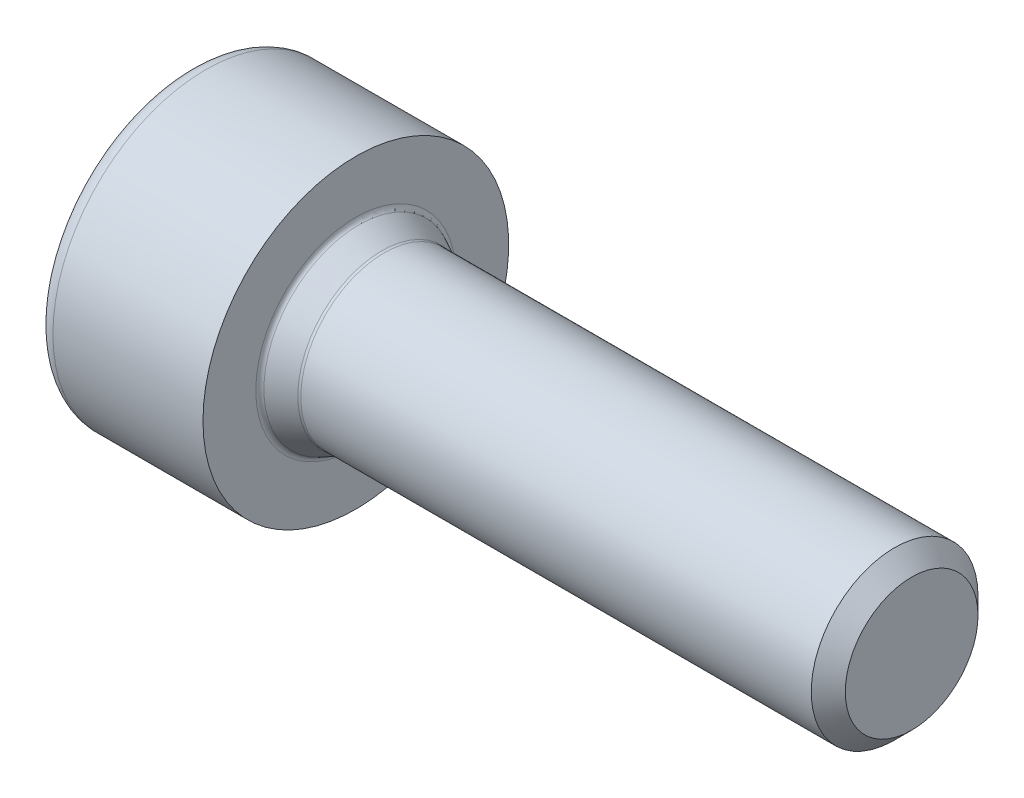
ISO-10303-21;
HEADER;
FILE_DESCRIPTION(('STEP AP214'),'2;1');
FILE_NAME('part.step','',(''),(''),'','','');
FILE_SCHEMA(('AUTOMOTIVE_DESIGN { 1 0 10303 214 1 1 1 1 }'));
ENDSEC;
DATA;
#1=APPLICATION_CONTEXT('core data for automotive mechanical design processes');
#2=APPLICATION_PROTOCOL_DEFINITION('international standard','automotive_design',2000,#1);
#3=PRODUCT_CONTEXT('',#1,'mechanical');
#4=PRODUCT('Part','Part','',(#3));
#5=PRODUCT_RELATED_PRODUCT_CATEGORY('part','',(#4));
#6=PRODUCT_DEFINITION_FORMATION('','',#4);
#7=PRODUCT_DEFINITION_CONTEXT('part definition',#1,'design');
#8=PRODUCT_DEFINITION('design','',#6,#7);
#9=PRODUCT_DEFINITION_SHAPE('','',#8);
#10=(LENGTH_UNIT() NAMED_UNIT(*) SI_UNIT(.MILLI.,.METRE.));
#11=(NAMED_UNIT(*) PLANE_ANGLE_UNIT() SI_UNIT($,.RADIAN.));
#12=(NAMED_UNIT(*) SI_UNIT($,.STERADIAN.) SOLID_ANGLE_UNIT());
#13=UNCERTAINTY_MEASURE_WITH_UNIT(LENGTH_MEASURE(1.E-05),#10,'distance_accuracy_value','');
#14=(GEOMETRIC_REPRESENTATION_CONTEXT(3) GLOBAL_UNCERTAINTY_ASSIGNED_CONTEXT((#13)) GLOBAL_UNIT_ASSIGNED_CONTEXT((#10,
#11,#12)) REPRESENTATION_CONTEXT('',''));
#15=CARTESIAN_POINT('',(0.,0.,0.));
#16=DIRECTION('',(0.,0.,1.));
#17=DIRECTION('',(1.,0.,0.));
#18=AXIS2_PLACEMENT_3D('',#15,#16,#17);
#19=CARTESIAN_POINT('',(-3.,-2.45,2.45));
#20=DIRECTION('',(-1.,0.,0.));
#21=DIRECTION('',(0.,1.,0.));
#22=AXIS2_PLACEMENT_3D('',#19,#20,#21);
#23=PLANE('',#22);
#24=CARTESIAN_POINT('',(-3.,0.,0.));
#25=DIRECTION('',(-1.,0.,0.));
#26=DIRECTION('',(0.,0.,-1.));
#27=AXIS2_PLACEMENT_3D('',#24,#25,#26);
#28=CIRCLE('',#27,2.45000003462729);
#29=CARTESIAN_POINT('',(-3.,0.,-2.45000003462729));
#30=VERTEX_POINT('',#29);
#31=EDGE_CURVE('E107',#30,#30,#28,.F.);
#32=ORIENTED_EDGE('',*,*,#31,.F.);
#33=EDGE_LOOP('',(#32));
#34=FACE_BOUND('',#33,.T.);
#35=DIRECTION('',(0.,-0.500000000000021,0.866025403784427));
#36=VECTOR('',#35,1.);
#37=CARTESIAN_POINT('',(-3.,1.4433756729741,0.));
#38=LINE('',#37,#36);
#39=CARTESIAN_POINT('',(-3.,1.4433756729741,0.));
#40=VERTEX_POINT('',#39);
#41=CARTESIAN_POINT('',(-3.,0.721687836487028,1.25));
#42=VERTEX_POINT('',#41);
#43=EDGE_CURVE('E90',#40,#42,#38,.T.);
#44=ORIENTED_EDGE('',*,*,#43,.T.);
#45=DIRECTION('',(0.,-1.,0.));
#46=VECTOR('',#45,1.);
#47=CARTESIAN_POINT('',(-3.,0.72168783648703,1.25));
#48=LINE('',#47,#46);
#49=CARTESIAN_POINT('',(-3.,-0.72168783648703,1.25));
#50=VERTEX_POINT('',#49);
#51=EDGE_CURVE('E104',#42,#50,#48,.T.);
#52=ORIENTED_EDGE('',*,*,#51,.T.);
#53=DIRECTION('',(0.,-0.50000000000002,-0.866025403784427));
#54=VECTOR('',#53,1.);
#55=CARTESIAN_POINT('',(-3.,-0.72168783648703,1.25));
#56=LINE('',#55,#54);
#57=CARTESIAN_POINT('',(-3.,-1.4433756729741,0.));
#58=VERTEX_POINT('',#57);
#59=EDGE_CURVE('E112',#50,#58,#56,.T.);
#60=ORIENTED_EDGE('',*,*,#59,.T.);
#61=DIRECTION('',(0.,0.50000000000002,-0.866025403784427));
#62=VECTOR('',#61,1.);
#63=CARTESIAN_POINT('',(-3.,-1.4433756729741,0.));
#64=LINE('',#63,#62);
#65=CARTESIAN_POINT('',(-3.,-0.72168783648703,-1.25));
#66=VERTEX_POINT('',#65);
#67=EDGE_CURVE('E114',#58,#66,#64,.T.);
#68=ORIENTED_EDGE('',*,*,#67,.T.);
#69=DIRECTION('',(0.,1.,0.));
#70=VECTOR('',#69,1.);
#71=CARTESIAN_POINT('',(-3.,-0.72168783648703,-1.25));
#72=LINE('',#71,#70);
#73=CARTESIAN_POINT('',(-3.,0.72168783648703,-1.25));
#74=VERTEX_POINT('',#73);
#75=EDGE_CURVE('E125',#66,#74,#72,.T.);
#76=ORIENTED_EDGE('',*,*,#75,.T.);
#77=DIRECTION('',(0.,0.500000000000021,0.866025403784427));
#78=VECTOR('',#77,1.);
#79=CARTESIAN_POINT('',(-3.,0.721687836487028,-1.25));
#80=LINE('',#79,#78);
#81=EDGE_CURVE('E106',#74,#40,#80,.T.);
#82=ORIENTED_EDGE('',*,*,#81,.T.);
#83=EDGE_LOOP('',(#44,#52,#60,#68,#76,#82));
#84=FACE_BOUND('',#83,.T.);
#85=ADVANCED_FACE('F17',(#34,#84),#23,.T.);
#86=CARTESIAN_POINT('',(0.,-2.75,-2.75));
#87=DIRECTION('',(1.,0.,0.));
#88=DIRECTION('',(0.,1.,0.));
#89=AXIS2_PLACEMENT_3D('',#86,#87,#88);
#90=PLANE('',#89);
#91=CARTESIAN_POINT('',(0.,0.,0.));
#92=DIRECTION('',(1.,0.,0.));
#93=DIRECTION('',(0.,0.,1.));
#94=AXIS2_PLACEMENT_3D('',#91,#92,#93);
#95=CIRCLE('',#94,2.75);
#96=CARTESIAN_POINT('',(0.,0.,2.75));
#97=VERTEX_POINT('',#96);
#98=EDGE_CURVE('E132',#97,#97,#95,.T.);
#99=ORIENTED_EDGE('',*,*,#98,.T.);
#100=EDGE_LOOP('',(#99));
#101=FACE_BOUND('',#100,.T.);
#102=CARTESIAN_POINT('',(0.,0.,0.));
#103=DIRECTION('',(-1.,0.,0.));
#104=DIRECTION('',(0.,0.,-1.));
#105=AXIS2_PLACEMENT_3D('',#102,#103,#104);
#106=CIRCLE('',#105,1.8);
#107=CARTESIAN_POINT('',(0.,0.,-1.8));
#108=VERTEX_POINT('',#107);
#109=EDGE_CURVE('E137',#108,#108,#106,.F.);
#110=ORIENTED_EDGE('',*,*,#109,.F.);
#111=EDGE_LOOP('',(#110));
#112=FACE_BOUND('',#111,.T.);
#113=ADVANCED_FACE('F276',(#101,#112),#90,.T.);
#114=CARTESIAN_POINT('',(10.,-1.20903464106758,-1.1935));
#115=DIRECTION('',(1.,0.,0.));
#116=DIRECTION('',(0.,1.,0.));
#117=AXIS2_PLACEMENT_3D('',#114,#115,#116);
#118=PLANE('',#117);
#119=CARTESIAN_POINT('',(10.,0.,0.));
#120=DIRECTION('',(1.,0.,0.));
#121=DIRECTION('',(0.,-1.41924965844718E-07,0.99999999999999));
#122=AXIS2_PLACEMENT_3D('',#119,#120,#121);
#123=CIRCLE('',#122,1.1935);
#124=CARTESIAN_POINT('',(10.,-1.69387446735671E-07,1.19349999999999));
#125=VERTEX_POINT('',#124);
#126=EDGE_CURVE('E140',#125,#125,#123,.T.);
#127=ORIENTED_EDGE('',*,*,#126,.T.);
#128=EDGE_LOOP('',(#127));
#129=FACE_BOUND('',#128,.T.);
#130=ADVANCED_FACE('F278',(#129),#118,.T.);
#131=CARTESIAN_POINT('',(-1.15,-1.08253175473054,-0.625000000000031));
#132=DIRECTION('',(-1.,0.,0.));
#133=DIRECTION('',(0.,1.,0.));
#134=AXIS2_PLACEMENT_3D('',#131,#132,#133);
#135=PLANE('',#134);
#136=DIRECTION('',(0.,-1.,0.));
#137=VECTOR('',#136,1.);
#138=CARTESIAN_POINT('',(-1.15,0.,-1.25));
#139=LINE('',#138,#137);
#140=CARTESIAN_POINT('',(-1.15,-0.72168783648703,-1.25));
#141=VERTEX_POINT('',#140);
#142=CARTESIAN_POINT('',(-1.15,0.,-1.25));
#143=VERTEX_POINT('',#142);
#144=EDGE_CURVE('E143',#141,#143,#139,.F.);
#145=ORIENTED_EDGE('',*,*,#144,.F.);
#146=DIRECTION('',(0.,-0.500000000000018,0.866025403784429));
#147=VECTOR('',#146,1.);
#148=CARTESIAN_POINT('',(-1.15,-0.721687836487029,-1.25));
#149=LINE('',#148,#147);
#150=CARTESIAN_POINT('',(-1.15,-1.08253175473054,-0.625000000000031));
#151=VERTEX_POINT('',#150);
#152=EDGE_CURVE('E146',#151,#141,#149,.F.);
#153=ORIENTED_EDGE('',*,*,#152,.F.);
#154=CARTESIAN_POINT('',(-1.15,0.,0.));
#155=DIRECTION('',(1.,0.,0.));
#156=DIRECTION('',(0.,-0.866025403784427,-0.50000000000002));
#157=AXIS2_PLACEMENT_3D('',#154,#155,#156);
#158=CIRCLE('',#157,1.25);
#159=EDGE_CURVE('E151',#151,#143,#158,.T.);
#160=ORIENTED_EDGE('',*,*,#159,.T.);
#161=EDGE_LOOP('',(#145,#153,#160));
#162=FACE_BOUND('',#161,.T.);
#163=ADVANCED_FACE('F286',(#162),#135,.T.);
#164=CARTESIAN_POINT('',(-1.15,-1.4433756729741,0.625000000000031));
#165=DIRECTION('',(-1.,0.,0.));
#166=DIRECTION('',(0.,1.,0.));
#167=AXIS2_PLACEMENT_3D('',#164,#165,#166);
#168=PLANE('',#167);
#169=DIRECTION('',(0.,-0.500000000000024,0.866025403784425));
#170=VECTOR('',#169,1.);
#171=CARTESIAN_POINT('',(-1.15,-1.08253175473054,-0.625000000000031));
#172=LINE('',#171,#170);
#173=CARTESIAN_POINT('',(-1.15,-1.4433756729741,0.));
#174=VERTEX_POINT('',#173);
#175=EDGE_CURVE('E156',#174,#151,#172,.F.);
#176=ORIENTED_EDGE('',*,*,#175,.F.);
#177=DIRECTION('',(0.,0.500000000000023,0.866025403784426));
#178=VECTOR('',#177,1.);
#179=CARTESIAN_POINT('',(-1.15,-1.4433756729741,0.));
#180=LINE('',#179,#178);
#181=CARTESIAN_POINT('',(-1.15,-1.08253175473054,0.625000000000031));
#182=VERTEX_POINT('',#181);
#183=EDGE_CURVE('E160',#182,#174,#180,.F.);
#184=ORIENTED_EDGE('',*,*,#183,.F.);
#185=CARTESIAN_POINT('',(-1.15,0.,0.));
#186=DIRECTION('',(1.,0.,0.));
#187=DIRECTION('',(0.,-0.866025403784427,0.50000000000002));
#188=AXIS2_PLACEMENT_3D('',#185,#186,#187);
#189=CIRCLE('',#188,1.25);
#190=EDGE_CURVE('E165',#182,#151,#189,.T.);
#191=ORIENTED_EDGE('',*,*,#190,.T.);
#192=EDGE_LOOP('',(#176,#184,#191));
#193=FACE_BOUND('',#192,.T.);
#194=ADVANCED_FACE('F294',(#193),#168,.T.);
#195=CARTESIAN_POINT('',(-1.15,-1.08253175473054,1.25));
#196=DIRECTION('',(-1.,0.,0.));
#197=DIRECTION('',(0.,1.,0.));
#198=AXIS2_PLACEMENT_3D('',#195,#196,#197);
#199=PLANE('',#198);
#200=DIRECTION('',(0.,0.500000000000018,0.866025403784429));
#201=VECTOR('',#200,1.);
#202=CARTESIAN_POINT('',(-1.15,-1.08253175473054,0.625000000000031));
#203=LINE('',#202,#201);
#204=CARTESIAN_POINT('',(-1.15,-0.72168783648703,1.25));
#205=VERTEX_POINT('',#204);
#206=EDGE_CURVE('E170',#205,#182,#203,.F.);
#207=ORIENTED_EDGE('',*,*,#206,.F.);
#208=DIRECTION('',(0.,1.,0.));
#209=VECTOR('',#208,1.);
#210=CARTESIAN_POINT('',(-1.15,-0.72168783648703,1.25));
#211=LINE('',#210,#209);
#212=CARTESIAN_POINT('',(-1.15,0.,1.25));
#213=VERTEX_POINT('',#212);
#214=EDGE_CURVE('E174',#213,#205,#211,.F.);
#215=ORIENTED_EDGE('',*,*,#214,.F.);
#216=CARTESIAN_POINT('',(-1.15,0.,0.));
#217=DIRECTION('',(1.,0.,0.));
#218=DIRECTION('',(0.,0.,1.));
#219=AXIS2_PLACEMENT_3D('',#216,#217,#218);
#220=CIRCLE('',#219,1.25);
#221=EDGE_CURVE('E178',#213,#182,#220,.T.);
#222=ORIENTED_EDGE('',*,*,#221,.T.);
#223=EDGE_LOOP('',(#207,#215,#222));
#224=FACE_BOUND('',#223,.T.);
#225=ADVANCED_FACE('F298',(#224),#199,.T.);
#226=CARTESIAN_POINT('',(-1.15,0.,1.25));
#227=DIRECTION('',(-1.,0.,0.));
#228=DIRECTION('',(0.,1.,0.));
#229=AXIS2_PLACEMENT_3D('',#226,#227,#228);
#230=PLANE('',#229);
#231=DIRECTION('',(0.,1.,0.));
#232=VECTOR('',#231,1.);
#233=CARTESIAN_POINT('',(-1.15,0.,1.25));
#234=LINE('',#233,#232);
#235=CARTESIAN_POINT('',(-1.15,0.72168783648703,1.25));
#236=VERTEX_POINT('',#235);
#237=EDGE_CURVE('E183',#236,#213,#234,.F.);
#238=ORIENTED_EDGE('',*,*,#237,.F.);
#239=DIRECTION('',(0.,0.500000000000018,-0.866025403784428));
#240=VECTOR('',#239,1.);
#241=CARTESIAN_POINT('',(-1.15,0.721687836487029,1.25));
#242=LINE('',#241,#240);
#243=CARTESIAN_POINT('',(-1.15,1.08253175473054,0.625000000000031));
#244=VERTEX_POINT('',#243);
#245=EDGE_CURVE('E93',#244,#236,#242,.F.);
#246=ORIENTED_EDGE('',*,*,#245,.F.);
#247=CARTESIAN_POINT('',(-1.15,0.,0.));
#248=DIRECTION('',(1.,0.,0.));
#249=DIRECTION('',(0.,0.866025403784427,0.50000000000002));
#250=AXIS2_PLACEMENT_3D('',#247,#248,#249);
#251=CIRCLE('',#250,1.25);
#252=EDGE_CURVE('E190',#244,#213,#251,.T.);
#253=ORIENTED_EDGE('',*,*,#252,.T.);
#254=EDGE_LOOP('',(#238,#246,#253));
#255=FACE_BOUND('',#254,.T.);
#256=ADVANCED_FACE('F302',(#255),#230,.T.);
#257=CARTESIAN_POINT('',(-1.15,1.08253175473054,0.625000000000031));
#258=DIRECTION('',(-1.,0.,0.));
#259=DIRECTION('',(0.,1.,0.));
#260=AXIS2_PLACEMENT_3D('',#257,#258,#259);
#261=PLANE('',#260);
#262=DIRECTION('',(0.,0.500000000000024,-0.866025403784425));
#263=VECTOR('',#262,1.);
#264=CARTESIAN_POINT('',(-1.15,1.08253175473054,0.625000000000031));
#265=LINE('',#264,#263);
#266=CARTESIAN_POINT('',(-1.15,1.4433756729741,0.));
#267=VERTEX_POINT('',#266);
#268=EDGE_CURVE('E195',#267,#244,#265,.F.);
#269=ORIENTED_EDGE('',*,*,#268,.F.);
#270=DIRECTION('',(0.,-0.500000000000023,-0.866025403784425));
#271=VECTOR('',#270,1.);
#272=CARTESIAN_POINT('',(-1.15,1.4433756729741,0.));
#273=LINE('',#272,#271);
#274=CARTESIAN_POINT('',(-1.15,1.08253175473054,-0.625000000000031));
#275=VERTEX_POINT('',#274);
#276=EDGE_CURVE('E199',#275,#267,#273,.F.);
#277=ORIENTED_EDGE('',*,*,#276,.F.);
#278=CARTESIAN_POINT('',(-1.15,0.,0.));
#279=DIRECTION('',(1.,0.,0.));
#280=DIRECTION('',(0.,0.866025403784427,-0.50000000000002));
#281=AXIS2_PLACEMENT_3D('',#278,#279,#280);
#282=CIRCLE('',#281,1.25);
#283=EDGE_CURVE('E204',#275,#244,#282,.T.);
#284=ORIENTED_EDGE('',*,*,#283,.T.);
#285=EDGE_LOOP('',(#269,#277,#284));
#286=FACE_BOUND('',#285,.T.);
#287=ADVANCED_FACE('F306',(#286),#261,.T.);
#288=CARTESIAN_POINT('',(-1.15,0.,-0.625000000000031));
#289=DIRECTION('',(-1.,0.,0.));
#290=DIRECTION('',(0.,1.,0.));
#291=AXIS2_PLACEMENT_3D('',#288,#289,#290);
#292=PLANE('',#291);
#293=DIRECTION('',(0.,-0.500000000000017,-0.866025403784429));
#294=VECTOR('',#293,1.);
#295=CARTESIAN_POINT('',(-1.15,1.08253175473054,-0.625000000000031));
#296=LINE('',#295,#294);
#297=CARTESIAN_POINT('',(-1.15,0.72168783648703,-1.25));
#298=VERTEX_POINT('',#297);
#299=EDGE_CURVE('E209',#298,#275,#296,.F.);
#300=ORIENTED_EDGE('',*,*,#299,.F.);
#301=DIRECTION('',(0.,-1.,0.));
#302=VECTOR('',#301,1.);
#303=CARTESIAN_POINT('',(-1.15,0.72168783648703,-1.25));
#304=LINE('',#303,#302);
#305=EDGE_CURVE('E213',#143,#298,#304,.F.);
#306=ORIENTED_EDGE('',*,*,#305,.F.);
#307=CARTESIAN_POINT('',(-1.15,0.,0.));
#308=DIRECTION('',(1.,0.,0.));
#309=DIRECTION('',(0.,0.,-1.));
#310=AXIS2_PLACEMENT_3D('',#307,#308,#309);
#311=CIRCLE('',#310,1.25);
#312=EDGE_CURVE('E218',#143,#275,#311,.T.);
#313=ORIENTED_EDGE('',*,*,#312,.T.);
#314=EDGE_LOOP('',(#300,#306,#313));
#315=FACE_BOUND('',#314,.T.);
#316=ADVANCED_FACE('F310',(#315),#292,.T.);
#317=CARTESIAN_POINT('',(-3.,-0.72168783648703,1.25));
#318=DIRECTION('',(0.,0.,-1.));
#319=DIRECTION('',(0.,1.,0.));
#320=AXIS2_PLACEMENT_3D('',#317,#318,#319);
#321=PLANE('',#320);
#322=ORIENTED_EDGE('',*,*,#214,.T.);
#323=DIRECTION('',(-1.,0.,0.));
#324=VECTOR('',#323,1.);
#325=CARTESIAN_POINT('',(-1.15,-0.72168783648703,1.25));
#326=LINE('',#325,#324);
#327=EDGE_CURVE('E98',#50,#205,#326,.F.);
#328=ORIENTED_EDGE('',*,*,#327,.F.);
#329=ORIENTED_EDGE('',*,*,#51,.F.);
#330=DIRECTION('',(1.,0.,0.));
#331=VECTOR('',#330,1.);
#332=CARTESIAN_POINT('',(-3.,0.72168783648703,1.25));
#333=LINE('',#332,#331);
#334=EDGE_CURVE('E87',#42,#236,#333,.T.);
#335=ORIENTED_EDGE('',*,*,#334,.T.);
#336=ORIENTED_EDGE('',*,*,#237,.T.);
#337=EDGE_LOOP('',(#322,#328,#329,#335,#336));
#338=FACE_BOUND('',#337,.T.);
#339=ADVANCED_FACE('F111',(#338),#321,.T.);
#340=CARTESIAN_POINT('',(-3.,-0.72168783648703,1.25));
#341=DIRECTION('',(0.,0.866025403784427,-0.50000000000002));
#342=DIRECTION('',(1.,0.,0.));
#343=AXIS2_PLACEMENT_3D('',#340,#341,#342);
#344=PLANE('',#343);
#345=ORIENTED_EDGE('',*,*,#183,.T.);
#346=DIRECTION('',(-1.,0.,0.));
#347=VECTOR('',#346,1.);
#348=CARTESIAN_POINT('',(-1.15,-1.4433756729741,0.));
#349=LINE('',#348,#347);
#350=EDGE_CURVE('E97',#58,#174,#349,.F.);
#351=ORIENTED_EDGE('',*,*,#350,.F.);
#352=ORIENTED_EDGE('',*,*,#59,.F.);
#353=ORIENTED_EDGE('',*,*,#327,.T.);
#354=ORIENTED_EDGE('',*,*,#206,.T.);
#355=EDGE_LOOP('',(#345,#351,#352,#353,#354));
#356=FACE_BOUND('',#355,.T.);
#357=ADVANCED_FACE('F317',(#356),#344,.T.);
#358=CARTESIAN_POINT('',(-3.,-1.4433756729741,0.));
#359=DIRECTION('',(0.,0.866025403784427,0.50000000000002));
#360=DIRECTION('',(1.,0.,0.));
#361=AXIS2_PLACEMENT_3D('',#358,#359,#360);
#362=PLANE('',#361);
#363=ORIENTED_EDGE('',*,*,#152,.T.);
#364=DIRECTION('',(-1.,0.,0.));
#365=VECTOR('',#364,1.);
#366=CARTESIAN_POINT('',(-1.15,-0.721687836487029,-1.25));
#367=LINE('',#366,#365);
#368=EDGE_CURVE('E231',#66,#141,#367,.F.);
#369=ORIENTED_EDGE('',*,*,#368,.F.);
#370=ORIENTED_EDGE('',*,*,#67,.F.);
#371=ORIENTED_EDGE('',*,*,#350,.T.);
#372=ORIENTED_EDGE('',*,*,#175,.T.);
#373=EDGE_LOOP('',(#363,#369,#370,#371,#372));
#374=FACE_BOUND('',#373,.T.);
#375=ADVANCED_FACE('F320',(#374),#362,.T.);
#376=CARTESIAN_POINT('',(-1.15,-0.72168783648703,-1.25));
#377=DIRECTION('',(0.,0.,1.));
#378=DIRECTION('',(0.,1.,0.));
#379=AXIS2_PLACEMENT_3D('',#376,#377,#378);
#380=PLANE('',#379);
#381=ORIENTED_EDGE('',*,*,#305,.T.);
#382=DIRECTION('',(-1.,0.,0.));
#383=VECTOR('',#382,1.);
#384=CARTESIAN_POINT('',(-1.15,0.72168783648703,-1.25));
#385=LINE('',#384,#383);
#386=EDGE_CURVE('E35',#74,#298,#385,.F.);
#387=ORIENTED_EDGE('',*,*,#386,.F.);
#388=ORIENTED_EDGE('',*,*,#75,.F.);
#389=ORIENTED_EDGE('',*,*,#368,.T.);
#390=ORIENTED_EDGE('',*,*,#144,.T.);
#391=EDGE_LOOP('',(#381,#387,#388,#389,#390));
#392=FACE_BOUND('',#391,.T.);
#393=ADVANCED_FACE('F324',(#392),#380,.T.);
#394=CARTESIAN_POINT('',(-3.,0.72168783648703,-1.25));
#395=DIRECTION('',(0.,-0.866025403784427,0.50000000000002));
#396=DIRECTION('',(1.,0.,0.));
#397=AXIS2_PLACEMENT_3D('',#394,#395,#396);
#398=PLANE('',#397);
#399=ORIENTED_EDGE('',*,*,#276,.T.);
#400=DIRECTION('',(-1.,0.,0.));
#401=VECTOR('',#400,1.);
#402=CARTESIAN_POINT('',(-1.15,1.4433756729741,0.));
#403=LINE('',#402,#401);
#404=EDGE_CURVE('E238',#40,#267,#403,.F.);
#405=ORIENTED_EDGE('',*,*,#404,.F.);
#406=ORIENTED_EDGE('',*,*,#81,.F.);
#407=ORIENTED_EDGE('',*,*,#386,.T.);
#408=ORIENTED_EDGE('',*,*,#299,.T.);
#409=EDGE_LOOP('',(#399,#405,#406,#407,#408));
#410=FACE_BOUND('',#409,.T.);
#411=ADVANCED_FACE('F328',(#410),#398,.T.);
#412=CARTESIAN_POINT('',(-3.,1.4433756729741,0.));
#413=DIRECTION('',(0.,-0.866025403784427,-0.50000000000002));
#414=DIRECTION('',(1.,0.,0.));
#415=AXIS2_PLACEMENT_3D('',#412,#413,#414);
#416=PLANE('',#415);
#417=ORIENTED_EDGE('',*,*,#245,.T.);
#418=ORIENTED_EDGE('',*,*,#334,.F.);
#419=ORIENTED_EDGE('',*,*,#43,.F.);
#420=ORIENTED_EDGE('',*,*,#404,.T.);
#421=ORIENTED_EDGE('',*,*,#268,.T.);
#422=EDGE_LOOP('',(#417,#418,#419,#420,#421));
#423=FACE_BOUND('',#422,.T.);
#424=ADVANCED_FACE('F89',(#423),#416,.T.);
#425=CARTESIAN_POINT('',(-2.70000000000012,0.,0.));
#426=DIRECTION('',(1.,0.,0.));
#427=DIRECTION('',(0.,0.,1.));
#428=AXIS2_PLACEMENT_3D('',#425,#426,#427);
#429=TOROIDAL_SURFACE('',#428,2.45000000000012,0.299999999999877);
#430=ORIENTED_EDGE('',*,*,#31,.T.);
#431=EDGE_LOOP('',(#430));
#432=FACE_BOUND('',#431,.T.);
#433=CARTESIAN_POINT('',(-2.70000000000012,0.,0.));
#434=DIRECTION('',(-1.,0.,0.));
#435=DIRECTION('',(0.,0.,-1.));
#436=AXIS2_PLACEMENT_3D('',#433,#434,#435);
#437=CIRCLE('',#436,2.75);
#438=CARTESIAN_POINT('',(-2.70000000000012,0.,-2.75));
#439=VERTEX_POINT('',#438);
#440=EDGE_CURVE('E242',#439,#439,#437,.F.);
#441=ORIENTED_EDGE('',*,*,#440,.F.);
#442=EDGE_LOOP('',(#441));
#443=FACE_BOUND('',#442,.T.);
#444=ADVANCED_FACE('F334',(#432,#443),#429,.T.);
#445=CARTESIAN_POINT('',(10.,0.,0.));
#446=DIRECTION('',(1.,0.,0.));
#447=DIRECTION('',(0.,0.,1.));
#448=AXIS2_PLACEMENT_3D('',#445,#446,#447);
#449=CYLINDRICAL_SURFACE('',#448,2.75);
#450=ORIENTED_EDGE('',*,*,#98,.F.);
#451=EDGE_LOOP('',(#450));
#452=FACE_BOUND('',#451,.T.);
#453=ORIENTED_EDGE('',*,*,#440,.T.);
#454=EDGE_LOOP('',(#453));
#455=FACE_BOUND('',#454,.T.);
#456=ADVANCED_FACE('F272',(#452,#455),#449,.T.);
#457=CARTESIAN_POINT('',(0.0999999999999613,0.,0.));
#458=DIRECTION('',(1.,0.,0.));
#459=DIRECTION('',(0.,1.42053901209034E-07,0.99999999999999));
#460=AXIS2_PLACEMENT_3D('',#457,#458,#459);
#461=TOROIDAL_SURFACE('',#460,1.79999999999996,0.0999999999999613);
#462=CARTESIAN_POINT('',(0.0561576367978582,0.,0.));
#463=DIRECTION('',(-1.,0.,0.));
#464=DIRECTION('',(0.,0.,-1.));
#465=AXIS2_PLACEMENT_3D('',#462,#463,#464);
#466=CIRCLE('',#465,1.7101231554356);
#467=CARTESIAN_POINT('',(0.0561576367978582,0.,-1.7101231554356));
#468=VERTEX_POINT('',#467);
#469=EDGE_CURVE('E247',#468,#468,#466,.F.);
#470=ORIENTED_EDGE('',*,*,#469,.F.);
#471=EDGE_LOOP('',(#470));
#472=FACE_BOUND('',#471,.T.);
#473=ORIENTED_EDGE('',*,*,#109,.T.);
#474=EDGE_LOOP('',(#473));
#475=FACE_BOUND('',#474,.T.);
#476=ADVANCED_FACE('F266',(#472,#475),#461,.F.);
#477=CARTESIAN_POINT('',(0.0561576367978587,0.,0.));
#478=DIRECTION('',(-1.,0.,0.));
#479=DIRECTION('',(0.,0.,-1.));
#480=AXIS2_PLACEMENT_3D('',#477,#478,#479);
#481=CONICAL_SURFACE('',#480,1.7101231554356,0.453844001521509);
#482=CARTESIAN_POINT('',(0.466157636797859,0.,0.));
#483=DIRECTION('',(-1.,0.,0.));
#484=DIRECTION('',(0.,0.,-1.));
#485=AXIS2_PLACEMENT_3D('',#482,#483,#484);
#486=CIRCLE('',#485,1.5101231554356);
#487=CARTESIAN_POINT('',(0.466157636797859,0.,-1.5101231554356));
#488=VERTEX_POINT('',#487);
#489=EDGE_CURVE('E250',#488,#488,#486,.F.);
#490=ORIENTED_EDGE('',*,*,#489,.F.);
#491=EDGE_LOOP('',(#490));
#492=FACE_BOUND('',#491,.T.);
#493=ORIENTED_EDGE('',*,*,#469,.T.);
#494=EDGE_LOOP('',(#493));
#495=FACE_BOUND('',#494,.T.);
#496=ADVANCED_FACE('F260',(#492,#495),#481,.T.);
#497=CARTESIAN_POINT('',(0.50999999999976,0.,0.));
#498=DIRECTION('',(1.,0.,0.));
#499=DIRECTION('',(0.,7.69380237637815E-10,1.));
#500=AXIS2_PLACEMENT_3D('',#497,#498,#499);
#501=TOROIDAL_SURFACE('',#500,1.59999999999904,0.0999999999990431);
#502=CARTESIAN_POINT('',(0.51,0.,0.));
#503=DIRECTION('',(-1.,0.,0.));
#504=DIRECTION('',(0.,0.,-1.));
#505=AXIS2_PLACEMENT_3D('',#502,#503,#504);
#506=CIRCLE('',#505,1.5);
#507=CARTESIAN_POINT('',(0.51,0.,-1.5));
#508=VERTEX_POINT('',#507);
#509=EDGE_CURVE('E25',#508,#508,#506,.F.);
#510=ORIENTED_EDGE('',*,*,#509,.F.);
#511=EDGE_LOOP('',(#510));
#512=FACE_BOUND('',#511,.T.);
#513=ORIENTED_EDGE('',*,*,#489,.T.);
#514=EDGE_LOOP('',(#513));
#515=FACE_BOUND('',#514,.T.);
#516=ADVANCED_FACE('F257',(#512,#515),#501,.F.);
#517=CARTESIAN_POINT('',(10.,0.,0.));
#518=DIRECTION('',(1.,0.,0.));
#519=DIRECTION('',(0.,0.,1.));
#520=AXIS2_PLACEMENT_3D('',#517,#518,#519);
#521=CYLINDRICAL_SURFACE('',#520,1.5);
#522=CARTESIAN_POINT('',(9.6935,0.,0.));
#523=DIRECTION('',(-1.,0.,0.));
#524=DIRECTION('',(0.,0.,-1.));
#525=AXIS2_PLACEMENT_3D('',#522,#523,#524);
#526=CIRCLE('',#525,1.5);
#527=CARTESIAN_POINT('',(9.6935,0.,-1.5));
#528=VERTEX_POINT('',#527);
#529=EDGE_CURVE('E11',#528,#528,#526,.F.);
#530=ORIENTED_EDGE('',*,*,#529,.F.);
#531=EDGE_LOOP('',(#530));
#532=FACE_BOUND('',#531,.T.);
#533=ORIENTED_EDGE('',*,*,#509,.T.);
#534=EDGE_LOOP('',(#533));
#535=FACE_BOUND('',#534,.T.);
#536=ADVANCED_FACE('F255',(#532,#535),#521,.T.);
#537=CARTESIAN_POINT('',(9.6935,0.,0.));
#538=DIRECTION('',(-1.,0.,0.));
#539=DIRECTION('',(0.,0.,-1.));
#540=AXIS2_PLACEMENT_3D('',#537,#538,#539);
#541=CONICAL_SURFACE('',#540,1.5,0.785398163397446);
#542=ORIENTED_EDGE('',*,*,#126,.F.);
#543=EDGE_LOOP('',(#542));
#544=FACE_BOUND('',#543,.T.);
#545=ORIENTED_EDGE('',*,*,#529,.T.);
#546=EDGE_LOOP('',(#545));
#547=FACE_BOUND('',#546,.T.);
#548=ADVANCED_FACE('F342',(#544,#547),#541,.T.);
#549=CARTESIAN_POINT('',(-1.15000000000001,0.,0.));
#550=DIRECTION('',(-1.,0.,0.));
#551=DIRECTION('',(0.,0.,-1.));
#552=AXIS2_PLACEMENT_3D('',#549,#550,#551);
#553=CONICAL_SURFACE('',#552,1.25000000000001,1.0471975511966);
#554=ORIENTED_EDGE('',*,*,#159,.F.);
#555=ORIENTED_EDGE('',*,*,#190,.F.);
#556=ORIENTED_EDGE('',*,*,#221,.F.);
#557=ORIENTED_EDGE('',*,*,#252,.F.);
#558=ORIENTED_EDGE('',*,*,#283,.F.);
#559=ORIENTED_EDGE('',*,*,#312,.F.);
#560=EDGE_LOOP('',(#554,#555,#556,#557,#558,#559));
#561=FACE_BOUND('',#560,.T.);
#562=CARTESIAN_POINT('',(-0.42831216351297,0.,0.));
#563=VERTEX_POINT('',#562);
#564=VERTEX_LOOP('',#563);
#565=FACE_BOUND('',#564,.T.);
#566=ADVANCED_FACE('F19',(#561,#565),#553,.F.);
#567=CLOSED_SHELL('',(#85,#113,#130,#163,#194,#225,#256,#287,#316,#339,#357,#375,#393,#411,#424,
#444,#456,#476,#496,#516,#536,#548,#566));
#568=MANIFOLD_SOLID_BREP('B1',#567);
#569=ADVANCED_BREP_SHAPE_REPRESENTATION('',(#18,#568),#14);
#570=SHAPE_DEFINITION_REPRESENTATION(#9,#569);
ENDSEC;
END-ISO-10303-21;
